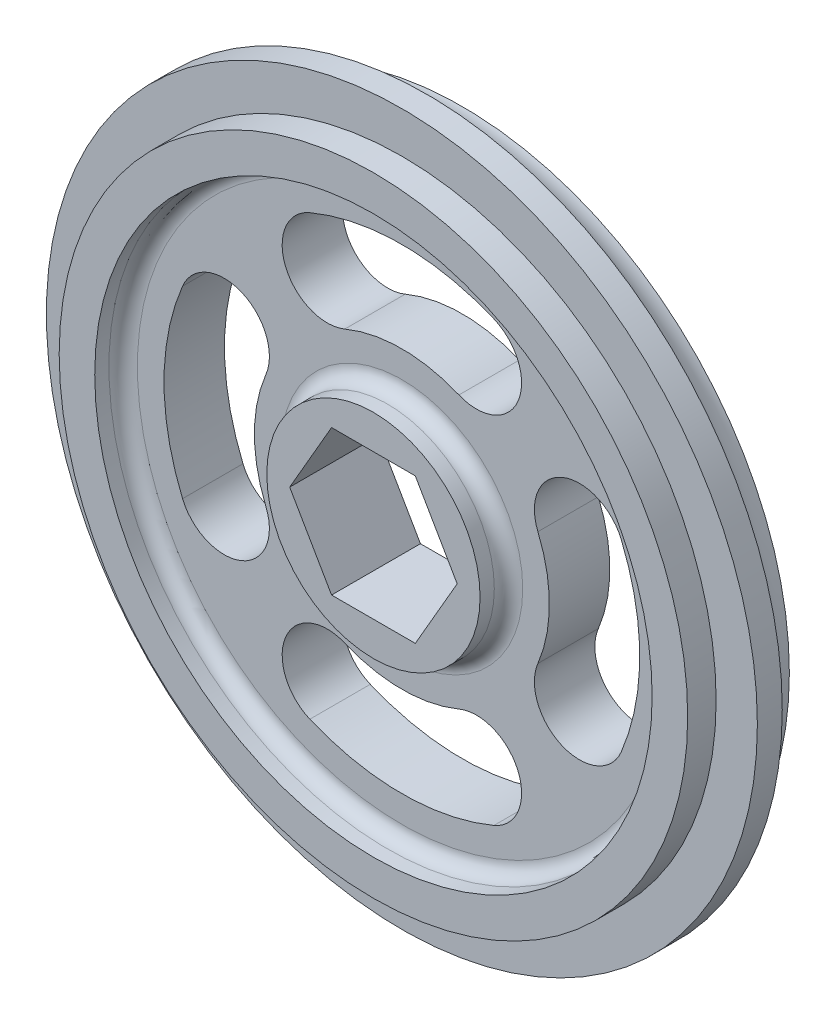
ISO-10303-21;
HEADER;
FILE_DESCRIPTION(('STEP AP214'),'2;1');
FILE_NAME('part.step','',(''),(''),'','','');
FILE_SCHEMA(('AUTOMOTIVE_DESIGN { 1 0 10303 214 1 1 1 1 }'));
ENDSEC;
DATA;
#1=APPLICATION_CONTEXT('core data for automotive mechanical design processes');
#2=APPLICATION_PROTOCOL_DEFINITION('international standard','automotive_design',2000,#1);
#3=PRODUCT_CONTEXT('',#1,'mechanical');
#4=PRODUCT('Part','Part','',(#3));
#5=PRODUCT_RELATED_PRODUCT_CATEGORY('part','',(#4));
#6=PRODUCT_DEFINITION_FORMATION('','',#4);
#7=PRODUCT_DEFINITION_CONTEXT('part definition',#1,'design');
#8=PRODUCT_DEFINITION('design','',#6,#7);
#9=PRODUCT_DEFINITION_SHAPE('','',#8);
#10=(LENGTH_UNIT() NAMED_UNIT(*) SI_UNIT(.MILLI.,.METRE.));
#11=(NAMED_UNIT(*) PLANE_ANGLE_UNIT() SI_UNIT($,.RADIAN.));
#12=(NAMED_UNIT(*) SI_UNIT($,.STERADIAN.) SOLID_ANGLE_UNIT());
#13=UNCERTAINTY_MEASURE_WITH_UNIT(LENGTH_MEASURE(1.E-05),#10,'distance_accuracy_value','');
#14=(GEOMETRIC_REPRESENTATION_CONTEXT(3) GLOBAL_UNCERTAINTY_ASSIGNED_CONTEXT((#13)) GLOBAL_UNIT_ASSIGNED_CONTEXT((#10,
#11,#12)) REPRESENTATION_CONTEXT('',''));
#15=CARTESIAN_POINT('',(0.,0.,0.));
#16=DIRECTION('',(0.,0.,1.));
#17=DIRECTION('',(1.,0.,0.));
#18=AXIS2_PLACEMENT_3D('',#15,#16,#17);
#19=CARTESIAN_POINT('',(-3.7394976935412,6.477,15.875));
#20=DIRECTION('',(0.866025403784439,-0.5,0.));
#21=DIRECTION('',(0.5,0.866025403784439,0.));
#22=AXIS2_PLACEMENT_3D('',#19,#20,#21);
#23=PLANE('',#22);
#24=DIRECTION('',(0.,0.,-1.));
#25=VECTOR('',#24,1.);
#26=CARTESIAN_POINT('',(-7.47899538708241,0.,15.875));
#27=LINE('',#26,#25);
#28=CARTESIAN_POINT('',(-7.47899538708241,0.,15.875));
#29=VERTEX_POINT('',#28);
#30=CARTESIAN_POINT('',(-7.47899538708241,0.,7.9375));
#31=VERTEX_POINT('',#30);
#32=EDGE_CURVE('E319',#29,#31,#27,.T.);
#33=ORIENTED_EDGE('',*,*,#32,.T.);
#34=DIRECTION('',(0.5,0.866025403784439,0.));
#35=VECTOR('',#34,1.);
#36=CARTESIAN_POINT('',(-3.7394976935412,6.477,7.9375));
#37=LINE('',#36,#35);
#38=CARTESIAN_POINT('',(-3.73949769354121,6.477,7.9375));
#39=VERTEX_POINT('',#38);
#40=EDGE_CURVE('E237',#31,#39,#37,.T.);
#41=ORIENTED_EDGE('',*,*,#40,.T.);
#42=DIRECTION('',(0.,0.,-1.));
#43=VECTOR('',#42,1.);
#44=CARTESIAN_POINT('',(-3.7394976935412,6.477,15.875));
#45=LINE('',#44,#43);
#46=CARTESIAN_POINT('',(-3.7394976935412,6.477,15.875));
#47=VERTEX_POINT('',#46);
#48=EDGE_CURVE('E304',#47,#39,#45,.T.);
#49=ORIENTED_EDGE('',*,*,#48,.F.);
#50=DIRECTION('',(-0.5,-0.866025403784439,0.));
#51=VECTOR('',#50,1.);
#52=CARTESIAN_POINT('',(-3.7394976935412,6.477,15.875));
#53=LINE('',#52,#51);
#54=EDGE_CURVE('E291',#47,#29,#53,.T.);
#55=ORIENTED_EDGE('',*,*,#54,.T.);
#56=EDGE_LOOP('',(#33,#41,#49,#55));
#57=FACE_BOUND('',#56,.T.);
#58=ADVANCED_FACE('F33',(#57),#23,.T.);
#59=CARTESIAN_POINT('',(-7.47899538708241,0.,15.875));
#60=DIRECTION('',(0.866025403784439,0.5,0.));
#61=DIRECTION('',(-0.5,0.866025403784439,0.));
#62=AXIS2_PLACEMENT_3D('',#59,#60,#61);
#63=PLANE('',#62);
#64=DIRECTION('',(0.,0.,-1.));
#65=VECTOR('',#64,1.);
#66=CARTESIAN_POINT('',(-3.73949769354121,-6.477,15.875));
#67=LINE('',#66,#65);
#68=CARTESIAN_POINT('',(-3.73949769354121,-6.477,15.875));
#69=VERTEX_POINT('',#68);
#70=CARTESIAN_POINT('',(-3.73949769354121,-6.477,7.9375));
#71=VERTEX_POINT('',#70);
#72=EDGE_CURVE('E316',#69,#71,#67,.T.);
#73=ORIENTED_EDGE('',*,*,#72,.T.);
#74=DIRECTION('',(-0.5,0.866025403784439,0.));
#75=VECTOR('',#74,1.);
#76=CARTESIAN_POINT('',(-7.47899538708241,0.,7.9375));
#77=LINE('',#76,#75);
#78=EDGE_CURVE('E400',#71,#31,#77,.T.);
#79=ORIENTED_EDGE('',*,*,#78,.T.);
#80=ORIENTED_EDGE('',*,*,#32,.F.);
#81=DIRECTION('',(0.5,-0.866025403784439,0.));
#82=VECTOR('',#81,1.);
#83=CARTESIAN_POINT('',(-7.47899538708241,0.,15.875));
#84=LINE('',#83,#82);
#85=EDGE_CURVE('E293',#29,#69,#84,.T.);
#86=ORIENTED_EDGE('',*,*,#85,.T.);
#87=EDGE_LOOP('',(#73,#79,#80,#86));
#88=FACE_BOUND('',#87,.T.);
#89=ADVANCED_FACE('F348',(#88),#63,.T.);
#90=CARTESIAN_POINT('',(-3.73949769354121,-6.477,15.875));
#91=DIRECTION('',(0.,1.,0.));
#92=DIRECTION('',(-1.,0.,0.));
#93=AXIS2_PLACEMENT_3D('',#90,#91,#92);
#94=PLANE('',#93);
#95=DIRECTION('',(0.,0.,-1.));
#96=VECTOR('',#95,1.);
#97=CARTESIAN_POINT('',(3.7394976935412,-6.477,15.875));
#98=LINE('',#97,#96);
#99=CARTESIAN_POINT('',(3.7394976935412,-6.477,15.875));
#100=VERTEX_POINT('',#99);
#101=CARTESIAN_POINT('',(3.7394976935412,-6.477,7.9375));
#102=VERTEX_POINT('',#101);
#103=EDGE_CURVE('E313',#100,#102,#98,.T.);
#104=ORIENTED_EDGE('',*,*,#103,.T.);
#105=DIRECTION('',(-1.,0.,0.));
#106=VECTOR('',#105,1.);
#107=CARTESIAN_POINT('',(-3.73949769354121,-6.477,7.9375));
#108=LINE('',#107,#106);
#109=EDGE_CURVE('E397',#102,#71,#108,.T.);
#110=ORIENTED_EDGE('',*,*,#109,.T.);
#111=ORIENTED_EDGE('',*,*,#72,.F.);
#112=DIRECTION('',(1.,0.,0.));
#113=VECTOR('',#112,1.);
#114=CARTESIAN_POINT('',(-3.73949769354121,-6.477,15.875));
#115=LINE('',#114,#113);
#116=EDGE_CURVE('E295',#69,#100,#115,.T.);
#117=ORIENTED_EDGE('',*,*,#116,.T.);
#118=EDGE_LOOP('',(#104,#110,#111,#117));
#119=FACE_BOUND('',#118,.T.);
#120=ADVANCED_FACE('F354',(#119),#94,.T.);
#121=CARTESIAN_POINT('',(3.7394976935412,-6.477,15.875));
#122=DIRECTION('',(-0.866025403784439,0.5,0.));
#123=DIRECTION('',(-0.5,-0.866025403784439,0.));
#124=AXIS2_PLACEMENT_3D('',#121,#122,#123);
#125=PLANE('',#124);
#126=DIRECTION('',(0.,0.,-1.));
#127=VECTOR('',#126,1.);
#128=CARTESIAN_POINT('',(7.47899538708241,0.,15.875));
#129=LINE('',#128,#127);
#130=CARTESIAN_POINT('',(7.47899538708241,0.,15.875));
#131=VERTEX_POINT('',#130);
#132=CARTESIAN_POINT('',(7.47899538708241,0.,7.9375));
#133=VERTEX_POINT('',#132);
#134=EDGE_CURVE('E310',#131,#133,#129,.T.);
#135=ORIENTED_EDGE('',*,*,#134,.T.);
#136=DIRECTION('',(-0.5,-0.866025403784439,0.));
#137=VECTOR('',#136,1.);
#138=CARTESIAN_POINT('',(3.7394976935412,-6.477,7.9375));
#139=LINE('',#138,#137);
#140=EDGE_CURVE('E394',#133,#102,#139,.T.);
#141=ORIENTED_EDGE('',*,*,#140,.T.);
#142=ORIENTED_EDGE('',*,*,#103,.F.);
#143=DIRECTION('',(0.5,0.866025403784439,0.));
#144=VECTOR('',#143,1.);
#145=CARTESIAN_POINT('',(3.7394976935412,-6.477,15.875));
#146=LINE('',#145,#144);
#147=EDGE_CURVE('E297',#100,#131,#146,.T.);
#148=ORIENTED_EDGE('',*,*,#147,.T.);
#149=EDGE_LOOP('',(#135,#141,#142,#148));
#150=FACE_BOUND('',#149,.T.);
#151=ADVANCED_FACE('F539',(#150),#125,.T.);
#152=CARTESIAN_POINT('',(7.47899538708241,0.,15.875));
#153=DIRECTION('',(-0.866025403784438,-0.5,0.));
#154=DIRECTION('',(0.5,-0.866025403784439,0.));
#155=AXIS2_PLACEMENT_3D('',#152,#153,#154);
#156=PLANE('',#155);
#157=DIRECTION('',(0.,0.,-1.));
#158=VECTOR('',#157,1.);
#159=CARTESIAN_POINT('',(3.7394976935412,6.477,15.875));
#160=LINE('',#159,#158);
#161=CARTESIAN_POINT('',(3.7394976935412,6.477,15.875));
#162=VERTEX_POINT('',#161);
#163=CARTESIAN_POINT('',(3.7394976935412,6.477,7.9375));
#164=VERTEX_POINT('',#163);
#165=EDGE_CURVE('E307',#162,#164,#160,.T.);
#166=ORIENTED_EDGE('',*,*,#165,.T.);
#167=DIRECTION('',(0.5,-0.866025403784439,0.));
#168=VECTOR('',#167,1.);
#169=CARTESIAN_POINT('',(7.47899538708241,0.,7.9375));
#170=LINE('',#169,#168);
#171=EDGE_CURVE('E48',#164,#133,#170,.T.);
#172=ORIENTED_EDGE('',*,*,#171,.T.);
#173=ORIENTED_EDGE('',*,*,#134,.F.);
#174=DIRECTION('',(-0.5,0.866025403784438,0.));
#175=VECTOR('',#174,1.);
#176=CARTESIAN_POINT('',(7.47899538708241,0.,15.875));
#177=LINE('',#176,#175);
#178=EDGE_CURVE('E299',#131,#162,#177,.T.);
#179=ORIENTED_EDGE('',*,*,#178,.T.);
#180=EDGE_LOOP('',(#166,#172,#173,#179));
#181=FACE_BOUND('',#180,.T.);
#182=ADVANCED_FACE('F535',(#181),#156,.T.);
#183=CARTESIAN_POINT('',(3.7394976935412,6.477,15.875));
#184=DIRECTION('',(0.,-1.,0.));
#185=DIRECTION('',(0.,0.,-1.));
#186=AXIS2_PLACEMENT_3D('',#183,#184,#185);
#187=PLANE('',#186);
#188=ORIENTED_EDGE('',*,*,#48,.T.);
#189=DIRECTION('',(1.,0.,0.));
#190=VECTOR('',#189,1.);
#191=CARTESIAN_POINT('',(3.7394976935412,6.477,7.9375));
#192=LINE('',#191,#190);
#193=EDGE_CURVE('E386',#39,#164,#192,.T.);
#194=ORIENTED_EDGE('',*,*,#193,.T.);
#195=ORIENTED_EDGE('',*,*,#165,.F.);
#196=DIRECTION('',(-1.,0.,0.));
#197=VECTOR('',#196,1.);
#198=CARTESIAN_POINT('',(3.7394976935412,6.477,15.875));
#199=LINE('',#198,#197);
#200=EDGE_CURVE('E302',#162,#47,#199,.T.);
#201=ORIENTED_EDGE('',*,*,#200,.T.);
#202=EDGE_LOOP('',(#188,#194,#195,#201));
#203=FACE_BOUND('',#202,.T.);
#204=ADVANCED_FACE('F380',(#203),#187,.T.);
#205=CARTESIAN_POINT('',(0.,0.,7.9375));
#206=DIRECTION('',(0.,0.,1.));
#207=DIRECTION('',(1.,0.,0.));
#208=AXIS2_PLACEMENT_3D('',#205,#206,#207);
#209=TOROIDAL_SURFACE('',#208,32.464375,3.254375);
#210=CARTESIAN_POINT('',(0.,0.,11.1125));
#211=DIRECTION('',(0.,0.,1.));
#212=DIRECTION('',(1.,0.,0.));
#213=AXIS2_PLACEMENT_3D('',#210,#211,#212);
#214=CIRCLE('',#213,31.75);
#215=CARTESIAN_POINT('',(31.75,0.,11.1125));
#216=VERTEX_POINT('',#215);
#217=EDGE_CURVE('E279',#216,#216,#214,.T.);
#218=ORIENTED_EDGE('',*,*,#217,.F.);
#219=EDGE_LOOP('',(#218));
#220=FACE_BOUND('',#219,.T.);
#221=CARTESIAN_POINT('',(0.,0.,7.9375));
#222=DIRECTION('',(0.,0.,1.));
#223=DIRECTION('',(1.,0.,0.));
#224=AXIS2_PLACEMENT_3D('',#221,#222,#223);
#225=CIRCLE('',#224,29.21);
#226=CARTESIAN_POINT('',(29.21,0.,7.9375));
#227=VERTEX_POINT('',#226);
#228=EDGE_CURVE('E384',#227,#227,#225,.T.);
#229=ORIENTED_EDGE('',*,*,#228,.T.);
#230=EDGE_LOOP('',(#229));
#231=FACE_BOUND('',#230,.T.);
#232=ADVANCED_FACE('F376',(#220,#231),#209,.F.);
#233=CARTESIAN_POINT('',(15.8685472556239,-6.65745298489088,0.));
#234=DIRECTION('',(0.,0.,1.));
#235=DIRECTION('',(1.,0.,0.));
#236=AXIS2_PLACEMENT_3D('',#233,#234,#235);
#237=CYLINDRICAL_SURFACE('',#236,4.03483822348317);
#238=CARTESIAN_POINT('',(15.8685472556239,-6.65745298489088,7.9375));
#239=DIRECTION('',(0.,0.,-1.));
#240=DIRECTION('',(-1.,0.,0.));
#241=AXIS2_PLACEMENT_3D('',#238,#239,#240);
#242=CIRCLE('',#241,4.03483822348317);
#243=CARTESIAN_POINT('',(12.1478847331413,-5.09649498306156,7.9375));
#244=VERTEX_POINT('',#243);
#245=CARTESIAN_POINT('',(19.5892097781064,-8.21841098672021,7.9375));
#246=VERTEX_POINT('',#245);
#247=EDGE_CURVE('E56',#244,#246,#242,.F.);
#248=ORIENTED_EDGE('',*,*,#247,.F.);
#249=DIRECTION('',(0.,0.,1.));
#250=VECTOR('',#249,1.);
#251=CARTESIAN_POINT('',(12.1478847331413,-5.09649498306156,0.));
#252=LINE('',#251,#250);
#253=CARTESIAN_POINT('',(12.1478847331413,-5.09649498306156,13.335));
#254=VERTEX_POINT('',#253);
#255=EDGE_CURVE('E266',#244,#254,#252,.T.);
#256=ORIENTED_EDGE('',*,*,#255,.T.);
#257=CARTESIAN_POINT('',(15.8685472556239,-6.65745298489088,13.335));
#258=DIRECTION('',(0.,0.,1.));
#259=DIRECTION('',(1.,0.,0.));
#260=AXIS2_PLACEMENT_3D('',#257,#258,#259);
#261=CIRCLE('',#260,4.03483822348317);
#262=CARTESIAN_POINT('',(19.5892097781064,-8.21841098672021,13.335));
#263=VERTEX_POINT('',#262);
#264=EDGE_CURVE('E253',#254,#263,#261,.T.);
#265=ORIENTED_EDGE('',*,*,#264,.T.);
#266=DIRECTION('',(0.,0.,1.));
#267=VECTOR('',#266,1.);
#268=CARTESIAN_POINT('',(19.5892097781064,-8.21841098672021,0.));
#269=LINE('',#268,#267);
#270=EDGE_CURVE('E265',#246,#263,#269,.T.);
#271=ORIENTED_EDGE('',*,*,#270,.F.);
#272=EDGE_LOOP('',(#248,#256,#265,#271));
#273=FACE_BOUND('',#272,.T.);
#274=ADVANCED_FACE('F379',(#273),#237,.F.);
#275=CARTESIAN_POINT('',(0.,0.,0.));
#276=DIRECTION('',(0.,0.,1.));
#277=DIRECTION('',(1.,0.,0.));
#278=AXIS2_PLACEMENT_3D('',#275,#276,#277);
#279=CYLINDRICAL_SURFACE('',#278,13.1736617765168);
#280=CARTESIAN_POINT('',(0.,0.,7.9375));
#281=DIRECTION('',(0.,0.,-1.));
#282=DIRECTION('',(-1.,0.,0.));
#283=AXIS2_PLACEMENT_3D('',#280,#281,#282);
#284=CIRCLE('',#283,13.1736617765168);
#285=CARTESIAN_POINT('',(12.1478847331413,5.09649498306156,7.9375));
#286=VERTEX_POINT('',#285);
#287=EDGE_CURVE('E389',#286,#244,#284,.T.);
#288=ORIENTED_EDGE('',*,*,#287,.F.);
#289=DIRECTION('',(0.,0.,1.));
#290=VECTOR('',#289,1.);
#291=CARTESIAN_POINT('',(12.1478847331413,5.09649498306156,0.));
#292=LINE('',#291,#290);
#293=CARTESIAN_POINT('',(12.1478847331413,5.09649498306156,13.335));
#294=VERTEX_POINT('',#293);
#295=EDGE_CURVE('E269',#286,#294,#292,.T.);
#296=ORIENTED_EDGE('',*,*,#295,.T.);
#297=CARTESIAN_POINT('',(0.,0.,13.335));
#298=DIRECTION('',(0.,0.,-1.));
#299=DIRECTION('',(1.,0.,0.));
#300=AXIS2_PLACEMENT_3D('',#297,#298,#299);
#301=CIRCLE('',#300,13.1736617765168);
#302=EDGE_CURVE('E262',#294,#254,#301,.T.);
#303=ORIENTED_EDGE('',*,*,#302,.T.);
#304=ORIENTED_EDGE('',*,*,#255,.F.);
#305=EDGE_LOOP('',(#288,#296,#303,#304));
#306=FACE_BOUND('',#305,.T.);
#307=ADVANCED_FACE('F442',(#306),#279,.T.);
#308=CARTESIAN_POINT('',(15.8685472556239,6.65745298489088,0.));
#309=DIRECTION('',(0.,0.,1.));
#310=DIRECTION('',(1.,0.,0.));
#311=AXIS2_PLACEMENT_3D('',#308,#309,#310);
#312=CYLINDRICAL_SURFACE('',#311,4.03483822348318);
#313=CARTESIAN_POINT('',(15.8685472556239,6.65745298489088,7.9375));
#314=DIRECTION('',(0.,0.,-1.));
#315=DIRECTION('',(-1.,0.,0.));
#316=AXIS2_PLACEMENT_3D('',#313,#314,#315);
#317=CIRCLE('',#316,4.03483822348318);
#318=CARTESIAN_POINT('',(19.5892097781064,8.2184109867202,7.9375));
#319=VERTEX_POINT('',#318);
#320=EDGE_CURVE('E448',#319,#286,#317,.F.);
#321=ORIENTED_EDGE('',*,*,#320,.F.);
#322=DIRECTION('',(0.,0.,1.));
#323=VECTOR('',#322,1.);
#324=CARTESIAN_POINT('',(19.5892097781064,8.2184109867202,0.));
#325=LINE('',#324,#323);
#326=CARTESIAN_POINT('',(19.5892097781064,8.2184109867202,13.335));
#327=VERTEX_POINT('',#326);
#328=EDGE_CURVE('E271',#319,#327,#325,.T.);
#329=ORIENTED_EDGE('',*,*,#328,.T.);
#330=CARTESIAN_POINT('',(15.8685472556239,6.65745298489088,13.335));
#331=DIRECTION('',(0.,0.,1.));
#332=DIRECTION('',(1.,0.,0.));
#333=AXIS2_PLACEMENT_3D('',#330,#331,#332);
#334=CIRCLE('',#333,4.03483822348318);
#335=EDGE_CURVE('E259',#327,#294,#334,.T.);
#336=ORIENTED_EDGE('',*,*,#335,.T.);
#337=ORIENTED_EDGE('',*,*,#295,.F.);
#338=EDGE_LOOP('',(#321,#329,#336,#337));
#339=FACE_BOUND('',#338,.T.);
#340=ADVANCED_FACE('F446',(#339),#312,.F.);
#341=CARTESIAN_POINT('',(0.,0.,0.));
#342=DIRECTION('',(0.,0.,1.));
#343=DIRECTION('',(1.,0.,0.));
#344=AXIS2_PLACEMENT_3D('',#341,#342,#343);
#345=CYLINDRICAL_SURFACE('',#344,21.2433382234832);
#346=CARTESIAN_POINT('',(0.,0.,7.9375));
#347=DIRECTION('',(0.,0.,-1.));
#348=DIRECTION('',(-1.,0.,0.));
#349=AXIS2_PLACEMENT_3D('',#346,#347,#348);
#350=CIRCLE('',#349,21.2433382234832);
#351=EDGE_CURVE('E451',#246,#319,#350,.F.);
#352=ORIENTED_EDGE('',*,*,#351,.F.);
#353=ORIENTED_EDGE('',*,*,#270,.T.);
#354=CARTESIAN_POINT('',(0.,0.,13.335));
#355=DIRECTION('',(0.,0.,1.));
#356=DIRECTION('',(1.,0.,0.));
#357=AXIS2_PLACEMENT_3D('',#354,#355,#356);
#358=CIRCLE('',#357,21.2433382234832);
#359=EDGE_CURVE('E256',#263,#327,#358,.T.);
#360=ORIENTED_EDGE('',*,*,#359,.T.);
#361=ORIENTED_EDGE('',*,*,#328,.F.);
#362=EDGE_LOOP('',(#352,#353,#360,#361));
#363=FACE_BOUND('',#362,.T.);
#364=ADVANCED_FACE('F450',(#363),#345,.F.);
#365=CARTESIAN_POINT('',(6.65745298489088,15.8685472556239,0.));
#366=DIRECTION('',(0.,0.,1.));
#367=DIRECTION('',(1.,0.,0.));
#368=AXIS2_PLACEMENT_3D('',#365,#366,#367);
#369=CYLINDRICAL_SURFACE('',#368,4.03483822348318);
#370=CARTESIAN_POINT('',(6.65745298489088,15.8685472556239,7.9375));
#371=DIRECTION('',(0.,0.,-1.));
#372=DIRECTION('',(-1.,0.,0.));
#373=AXIS2_PLACEMENT_3D('',#370,#371,#372);
#374=CIRCLE('',#373,4.03483822348318);
#375=CARTESIAN_POINT('',(5.09649498306156,12.1478847331414,7.9375));
#376=VERTEX_POINT('',#375);
#377=CARTESIAN_POINT('',(8.2184109867202,19.5892097781064,7.9375));
#378=VERTEX_POINT('',#377);
#379=EDGE_CURVE('E452',#376,#378,#374,.F.);
#380=ORIENTED_EDGE('',*,*,#379,.F.);
#381=DIRECTION('',(0.,0.,1.));
#382=VECTOR('',#381,1.);
#383=CARTESIAN_POINT('',(5.09649498306156,12.1478847331414,0.));
#384=LINE('',#383,#382);
#385=CARTESIAN_POINT('',(5.09649498306156,12.1478847331414,13.335));
#386=VERTEX_POINT('',#385);
#387=EDGE_CURVE('E215',#376,#386,#384,.T.);
#388=ORIENTED_EDGE('',*,*,#387,.T.);
#389=CARTESIAN_POINT('',(6.65745298489088,15.8685472556239,13.335));
#390=DIRECTION('',(0.,0.,1.));
#391=DIRECTION('',(1.,0.,0.));
#392=AXIS2_PLACEMENT_3D('',#389,#390,#391);
#393=CIRCLE('',#392,4.03483822348318);
#394=CARTESIAN_POINT('',(8.2184109867202,19.5892097781064,13.335));
#395=VERTEX_POINT('',#394);
#396=EDGE_CURVE('E233',#386,#395,#393,.T.);
#397=ORIENTED_EDGE('',*,*,#396,.T.);
#398=DIRECTION('',(0.,0.,1.));
#399=VECTOR('',#398,1.);
#400=CARTESIAN_POINT('',(8.2184109867202,19.5892097781064,0.));
#401=LINE('',#400,#399);
#402=EDGE_CURVE('E246',#378,#395,#401,.T.);
#403=ORIENTED_EDGE('',*,*,#402,.F.);
#404=EDGE_LOOP('',(#380,#388,#397,#403));
#405=FACE_BOUND('',#404,.T.);
#406=ADVANCED_FACE('F506',(#405),#369,.F.);
#407=CARTESIAN_POINT('',(0.,0.,0.));
#408=DIRECTION('',(0.,0.,1.));
#409=DIRECTION('',(1.,0.,0.));
#410=AXIS2_PLACEMENT_3D('',#407,#408,#409);
#411=CYLINDRICAL_SURFACE('',#410,13.1736617765168);
#412=CARTESIAN_POINT('',(0.,0.,7.9375));
#413=DIRECTION('',(0.,0.,-1.));
#414=DIRECTION('',(-1.,0.,0.));
#415=AXIS2_PLACEMENT_3D('',#412,#413,#414);
#416=CIRCLE('',#415,13.1736617765168);
#417=CARTESIAN_POINT('',(-5.09649498306156,12.1478847331414,7.9375));
#418=VERTEX_POINT('',#417);
#419=EDGE_CURVE('E455',#418,#376,#416,.T.);
#420=ORIENTED_EDGE('',*,*,#419,.F.);
#421=DIRECTION('',(0.,0.,1.));
#422=VECTOR('',#421,1.);
#423=CARTESIAN_POINT('',(-5.09649498306156,12.1478847331414,0.));
#424=LINE('',#423,#422);
#425=CARTESIAN_POINT('',(-5.09649498306156,12.1478847331414,13.335));
#426=VERTEX_POINT('',#425);
#427=EDGE_CURVE('E248',#418,#426,#424,.T.);
#428=ORIENTED_EDGE('',*,*,#427,.T.);
#429=CARTESIAN_POINT('',(0.,0.,13.335));
#430=DIRECTION('',(0.,0.,-1.));
#431=DIRECTION('',(1.,0.,0.));
#432=AXIS2_PLACEMENT_3D('',#429,#430,#431);
#433=CIRCLE('',#432,13.1736617765168);
#434=EDGE_CURVE('E243',#426,#386,#433,.T.);
#435=ORIENTED_EDGE('',*,*,#434,.T.);
#436=ORIENTED_EDGE('',*,*,#387,.F.);
#437=EDGE_LOOP('',(#420,#428,#435,#436));
#438=FACE_BOUND('',#437,.T.);
#439=ADVANCED_FACE('F503',(#438),#411,.T.);
#440=CARTESIAN_POINT('',(-6.65745298489088,15.8685472556239,0.));
#441=DIRECTION('',(0.,0.,1.));
#442=DIRECTION('',(1.,0.,0.));
#443=AXIS2_PLACEMENT_3D('',#440,#441,#442);
#444=CYLINDRICAL_SURFACE('',#443,4.03483822348318);
#445=CARTESIAN_POINT('',(-6.65745298489088,15.8685472556239,7.9375));
#446=DIRECTION('',(0.,0.,-1.));
#447=DIRECTION('',(-1.,0.,0.));
#448=AXIS2_PLACEMENT_3D('',#445,#446,#447);
#449=CIRCLE('',#448,4.03483822348318);
#450=CARTESIAN_POINT('',(-8.2184109867202,19.5892097781064,7.9375));
#451=VERTEX_POINT('',#450);
#452=EDGE_CURVE('E459',#451,#418,#449,.F.);
#453=ORIENTED_EDGE('',*,*,#452,.F.);
#454=DIRECTION('',(0.,0.,1.));
#455=VECTOR('',#454,1.);
#456=CARTESIAN_POINT('',(-8.2184109867202,19.5892097781064,0.));
#457=LINE('',#456,#455);
#458=CARTESIAN_POINT('',(-8.2184109867202,19.5892097781064,13.335));
#459=VERTEX_POINT('',#458);
#460=EDGE_CURVE('E250',#451,#459,#457,.T.);
#461=ORIENTED_EDGE('',*,*,#460,.T.);
#462=CARTESIAN_POINT('',(-6.65745298489088,15.8685472556239,13.335));
#463=DIRECTION('',(0.,0.,1.));
#464=DIRECTION('',(1.,0.,0.));
#465=AXIS2_PLACEMENT_3D('',#462,#463,#464);
#466=CIRCLE('',#465,4.03483822348318);
#467=EDGE_CURVE('E240',#459,#426,#466,.T.);
#468=ORIENTED_EDGE('',*,*,#467,.T.);
#469=ORIENTED_EDGE('',*,*,#427,.F.);
#470=EDGE_LOOP('',(#453,#461,#468,#469));
#471=FACE_BOUND('',#470,.T.);
#472=ADVANCED_FACE('F497',(#471),#444,.F.);
#473=CARTESIAN_POINT('',(0.,0.,0.));
#474=DIRECTION('',(0.,0.,1.));
#475=DIRECTION('',(1.,0.,0.));
#476=AXIS2_PLACEMENT_3D('',#473,#474,#475);
#477=CYLINDRICAL_SURFACE('',#476,21.2433382234832);
#478=CARTESIAN_POINT('',(0.,0.,7.9375));
#479=DIRECTION('',(0.,0.,-1.));
#480=DIRECTION('',(-1.,0.,0.));
#481=AXIS2_PLACEMENT_3D('',#478,#479,#480);
#482=CIRCLE('',#481,21.2433382234832);
#483=EDGE_CURVE('E461',#378,#451,#482,.F.);
#484=ORIENTED_EDGE('',*,*,#483,.F.);
#485=ORIENTED_EDGE('',*,*,#402,.T.);
#486=CARTESIAN_POINT('',(0.,0.,13.335));
#487=DIRECTION('',(0.,0.,1.));
#488=DIRECTION('',(1.,0.,0.));
#489=AXIS2_PLACEMENT_3D('',#486,#487,#488);
#490=CIRCLE('',#489,21.2433382234832);
#491=EDGE_CURVE('E236',#395,#459,#490,.T.);
#492=ORIENTED_EDGE('',*,*,#491,.T.);
#493=ORIENTED_EDGE('',*,*,#460,.F.);
#494=EDGE_LOOP('',(#484,#485,#492,#493));
#495=FACE_BOUND('',#494,.T.);
#496=ADVANCED_FACE('F490',(#495),#477,.F.);
#497=CARTESIAN_POINT('',(-15.8685472556239,6.65745298489088,0.));
#498=DIRECTION('',(0.,0.,1.));
#499=DIRECTION('',(1.,0.,0.));
#500=AXIS2_PLACEMENT_3D('',#497,#498,#499);
#501=CYLINDRICAL_SURFACE('',#500,4.03483822348318);
#502=CARTESIAN_POINT('',(-15.8685472556239,6.65745298489088,7.9375));
#503=DIRECTION('',(0.,0.,-1.));
#504=DIRECTION('',(-1.,0.,0.));
#505=AXIS2_PLACEMENT_3D('',#502,#503,#504);
#506=CIRCLE('',#505,4.03483822348318);
#507=CARTESIAN_POINT('',(-12.1478847331414,5.09649498306156,7.9375));
#508=VERTEX_POINT('',#507);
#509=CARTESIAN_POINT('',(-19.5892097781064,8.21841098672021,7.9375));
#510=VERTEX_POINT('',#509);
#511=EDGE_CURVE('E463',#508,#510,#506,.F.);
#512=ORIENTED_EDGE('',*,*,#511,.F.);
#513=DIRECTION('',(0.,0.,1.));
#514=VECTOR('',#513,1.);
#515=CARTESIAN_POINT('',(-12.1478847331414,5.09649498306156,0.));
#516=LINE('',#515,#514);
#517=CARTESIAN_POINT('',(-12.1478847331414,5.09649498306156,13.335));
#518=VERTEX_POINT('',#517);
#519=EDGE_CURVE('E225',#508,#518,#516,.T.);
#520=ORIENTED_EDGE('',*,*,#519,.T.);
#521=CARTESIAN_POINT('',(-15.8685472556239,6.65745298489088,13.335));
#522=DIRECTION('',(0.,0.,1.));
#523=DIRECTION('',(1.,0.,0.));
#524=AXIS2_PLACEMENT_3D('',#521,#522,#523);
#525=CIRCLE('',#524,4.03483822348318);
#526=CARTESIAN_POINT('',(-19.5892097781064,8.21841098672021,13.335));
#527=VERTEX_POINT('',#526);
#528=EDGE_CURVE('E211',#518,#527,#525,.T.);
#529=ORIENTED_EDGE('',*,*,#528,.T.);
#530=DIRECTION('',(0.,0.,1.));
#531=VECTOR('',#530,1.);
#532=CARTESIAN_POINT('',(-19.5892097781064,8.21841098672021,0.));
#533=LINE('',#532,#531);
#534=EDGE_CURVE('E224',#510,#527,#533,.T.);
#535=ORIENTED_EDGE('',*,*,#534,.F.);
#536=EDGE_LOOP('',(#512,#520,#529,#535));
#537=FACE_BOUND('',#536,.T.);
#538=ADVANCED_FACE('F488',(#537),#501,.F.);
#539=CARTESIAN_POINT('',(0.,0.,0.));
#540=DIRECTION('',(0.,0.,1.));
#541=DIRECTION('',(1.,0.,0.));
#542=AXIS2_PLACEMENT_3D('',#539,#540,#541);
#543=CYLINDRICAL_SURFACE('',#542,13.1736617765168);
#544=CARTESIAN_POINT('',(0.,0.,7.9375));
#545=DIRECTION('',(0.,0.,-1.));
#546=DIRECTION('',(-1.,0.,0.));
#547=AXIS2_PLACEMENT_3D('',#544,#545,#546);
#548=CIRCLE('',#547,13.1736617765168);
#549=CARTESIAN_POINT('',(-12.1478847331413,-5.09649498306156,7.9375));
#550=VERTEX_POINT('',#549);
#551=EDGE_CURVE('E465',#550,#508,#548,.T.);
#552=ORIENTED_EDGE('',*,*,#551,.F.);
#553=DIRECTION('',(0.,0.,1.));
#554=VECTOR('',#553,1.);
#555=CARTESIAN_POINT('',(-12.1478847331413,-5.09649498306156,0.));
#556=LINE('',#555,#554);
#557=CARTESIAN_POINT('',(-12.1478847331413,-5.09649498306156,13.335));
#558=VERTEX_POINT('',#557);
#559=EDGE_CURVE('E228',#550,#558,#556,.T.);
#560=ORIENTED_EDGE('',*,*,#559,.T.);
#561=CARTESIAN_POINT('',(0.,0.,13.335));
#562=DIRECTION('',(0.,0.,-1.));
#563=DIRECTION('',(1.,0.,0.));
#564=AXIS2_PLACEMENT_3D('',#561,#562,#563);
#565=CIRCLE('',#564,13.1736617765168);
#566=EDGE_CURVE('E221',#558,#518,#565,.T.);
#567=ORIENTED_EDGE('',*,*,#566,.T.);
#568=ORIENTED_EDGE('',*,*,#519,.F.);
#569=EDGE_LOOP('',(#552,#560,#567,#568));
#570=FACE_BOUND('',#569,.T.);
#571=ADVANCED_FACE('F486',(#570),#543,.T.);
#572=CARTESIAN_POINT('',(-15.8685472556239,-6.65745298489088,0.));
#573=DIRECTION('',(0.,0.,1.));
#574=DIRECTION('',(1.,0.,0.));
#575=AXIS2_PLACEMENT_3D('',#572,#573,#574);
#576=CYLINDRICAL_SURFACE('',#575,4.03483822348318);
#577=CARTESIAN_POINT('',(-15.8685472556239,-6.65745298489088,7.9375));
#578=DIRECTION('',(0.,0.,-1.));
#579=DIRECTION('',(-1.,0.,0.));
#580=AXIS2_PLACEMENT_3D('',#577,#578,#579);
#581=CIRCLE('',#580,4.03483822348318);
#582=CARTESIAN_POINT('',(-19.5892097781064,-8.2184109867202,7.9375));
#583=VERTEX_POINT('',#582);
#584=EDGE_CURVE('E467',#583,#550,#581,.F.);
#585=ORIENTED_EDGE('',*,*,#584,.F.);
#586=DIRECTION('',(0.,0.,1.));
#587=VECTOR('',#586,1.);
#588=CARTESIAN_POINT('',(-19.5892097781064,-8.2184109867202,0.));
#589=LINE('',#588,#587);
#590=CARTESIAN_POINT('',(-19.5892097781064,-8.2184109867202,13.335));
#591=VERTEX_POINT('',#590);
#592=EDGE_CURVE('E230',#583,#591,#589,.T.);
#593=ORIENTED_EDGE('',*,*,#592,.T.);
#594=CARTESIAN_POINT('',(-15.8685472556239,-6.65745298489088,13.335));
#595=DIRECTION('',(0.,0.,1.));
#596=DIRECTION('',(1.,0.,0.));
#597=AXIS2_PLACEMENT_3D('',#594,#595,#596);
#598=CIRCLE('',#597,4.03483822348318);
#599=EDGE_CURVE('E218',#591,#558,#598,.T.);
#600=ORIENTED_EDGE('',*,*,#599,.T.);
#601=ORIENTED_EDGE('',*,*,#559,.F.);
#602=EDGE_LOOP('',(#585,#593,#600,#601));
#603=FACE_BOUND('',#602,.T.);
#604=ADVANCED_FACE('F481',(#603),#576,.F.);
#605=CARTESIAN_POINT('',(0.,0.,0.));
#606=DIRECTION('',(0.,0.,1.));
#607=DIRECTION('',(1.,0.,0.));
#608=AXIS2_PLACEMENT_3D('',#605,#606,#607);
#609=CYLINDRICAL_SURFACE('',#608,21.2433382234832);
#610=CARTESIAN_POINT('',(0.,0.,7.9375));
#611=DIRECTION('',(0.,0.,-1.));
#612=DIRECTION('',(-1.,0.,0.));
#613=AXIS2_PLACEMENT_3D('',#610,#611,#612);
#614=CIRCLE('',#613,21.2433382234832);
#615=EDGE_CURVE('E469',#510,#583,#614,.F.);
#616=ORIENTED_EDGE('',*,*,#615,.F.);
#617=ORIENTED_EDGE('',*,*,#534,.T.);
#618=CARTESIAN_POINT('',(0.,0.,13.335));
#619=DIRECTION('',(0.,0.,1.));
#620=DIRECTION('',(1.,0.,0.));
#621=AXIS2_PLACEMENT_3D('',#618,#619,#620);
#622=CIRCLE('',#621,21.2433382234832);
#623=EDGE_CURVE('E214',#527,#591,#622,.T.);
#624=ORIENTED_EDGE('',*,*,#623,.T.);
#625=ORIENTED_EDGE('',*,*,#592,.F.);
#626=EDGE_LOOP('',(#616,#617,#624,#625));
#627=FACE_BOUND('',#626,.T.);
#628=ADVANCED_FACE('F482',(#627),#609,.F.);
#629=CARTESIAN_POINT('',(-6.65745298489088,-15.8685472556239,0.));
#630=DIRECTION('',(0.,0.,1.));
#631=DIRECTION('',(1.,0.,0.));
#632=AXIS2_PLACEMENT_3D('',#629,#630,#631);
#633=CYLINDRICAL_SURFACE('',#632,4.03483822348318);
#634=CARTESIAN_POINT('',(-6.65745298489088,-15.8685472556239,7.9375));
#635=DIRECTION('',(0.,0.,-1.));
#636=DIRECTION('',(-1.,0.,0.));
#637=AXIS2_PLACEMENT_3D('',#634,#635,#636);
#638=CIRCLE('',#637,4.03483822348318);
#639=CARTESIAN_POINT('',(-5.09649498306156,-12.1478847331414,7.9375));
#640=VERTEX_POINT('',#639);
#641=CARTESIAN_POINT('',(-8.2184109867202,-19.5892097781064,7.9375));
#642=VERTEX_POINT('',#641);
#643=EDGE_CURVE('E186',#640,#642,#638,.F.);
#644=ORIENTED_EDGE('',*,*,#643,.F.);
#645=DIRECTION('',(0.,0.,1.));
#646=VECTOR('',#645,1.);
#647=CARTESIAN_POINT('',(-5.09649498306156,-12.1478847331414,0.));
#648=LINE('',#647,#646);
#649=CARTESIAN_POINT('',(-5.09649498306156,-12.1478847331414,13.335));
#650=VERTEX_POINT('',#649);
#651=EDGE_CURVE('E205',#640,#650,#648,.T.);
#652=ORIENTED_EDGE('',*,*,#651,.T.);
#653=CARTESIAN_POINT('',(-6.65745298489088,-15.8685472556239,13.335));
#654=DIRECTION('',(0.,0.,1.));
#655=DIRECTION('',(1.,0.,0.));
#656=AXIS2_PLACEMENT_3D('',#653,#654,#655);
#657=CIRCLE('',#656,4.03483822348318);
#658=CARTESIAN_POINT('',(-8.2184109867202,-19.5892097781064,13.335));
#659=VERTEX_POINT('',#658);
#660=EDGE_CURVE('E227',#650,#659,#657,.T.);
#661=ORIENTED_EDGE('',*,*,#660,.T.);
#662=DIRECTION('',(0.,0.,1.));
#663=VECTOR('',#662,1.);
#664=CARTESIAN_POINT('',(-8.2184109867202,-19.5892097781064,0.));
#665=LINE('',#664,#663);
#666=EDGE_CURVE('E203',#642,#659,#665,.T.);
#667=ORIENTED_EDGE('',*,*,#666,.F.);
#668=EDGE_LOOP('',(#644,#652,#661,#667));
#669=FACE_BOUND('',#668,.T.);
#670=ADVANCED_FACE('F413',(#669),#633,.F.);
#671=CARTESIAN_POINT('',(0.,0.,0.));
#672=DIRECTION('',(0.,0.,1.));
#673=DIRECTION('',(1.,0.,0.));
#674=AXIS2_PLACEMENT_3D('',#671,#672,#673);
#675=CYLINDRICAL_SURFACE('',#674,13.1736617765168);
#676=CARTESIAN_POINT('',(0.,0.,7.9375));
#677=DIRECTION('',(0.,0.,-1.));
#678=DIRECTION('',(-1.,0.,0.));
#679=AXIS2_PLACEMENT_3D('',#676,#677,#678);
#680=CIRCLE('',#679,13.1736617765168);
#681=CARTESIAN_POINT('',(5.09649498306156,-12.1478847331414,7.9375));
#682=VERTEX_POINT('',#681);
#683=EDGE_CURVE('E197',#682,#640,#680,.T.);
#684=ORIENTED_EDGE('',*,*,#683,.F.);
#685=DIRECTION('',(0.,0.,1.));
#686=VECTOR('',#685,1.);
#687=CARTESIAN_POINT('',(5.09649498306156,-12.1478847331414,0.));
#688=LINE('',#687,#686);
#689=CARTESIAN_POINT('',(5.09649498306156,-12.1478847331414,13.335));
#690=VERTEX_POINT('',#689);
#691=EDGE_CURVE('E196',#682,#690,#688,.T.);
#692=ORIENTED_EDGE('',*,*,#691,.T.);
#693=CARTESIAN_POINT('',(0.,0.,13.335));
#694=DIRECTION('',(0.,0.,-1.));
#695=DIRECTION('',(1.,0.,0.));
#696=AXIS2_PLACEMENT_3D('',#693,#694,#695);
#697=CIRCLE('',#696,13.1736617765168);
#698=EDGE_CURVE('E207',#690,#650,#697,.T.);
#699=ORIENTED_EDGE('',*,*,#698,.T.);
#700=ORIENTED_EDGE('',*,*,#651,.F.);
#701=EDGE_LOOP('',(#684,#692,#699,#700));
#702=FACE_BOUND('',#701,.T.);
#703=ADVANCED_FACE('F417',(#702),#675,.T.);
#704=CARTESIAN_POINT('',(6.65745298489088,-15.8685472556239,0.));
#705=DIRECTION('',(0.,0.,1.));
#706=DIRECTION('',(1.,0.,0.));
#707=AXIS2_PLACEMENT_3D('',#704,#705,#706);
#708=CYLINDRICAL_SURFACE('',#707,4.03483822348317);
#709=CARTESIAN_POINT('',(6.65745298489088,-15.8685472556239,7.9375));
#710=DIRECTION('',(0.,0.,-1.));
#711=DIRECTION('',(-1.,0.,0.));
#712=AXIS2_PLACEMENT_3D('',#709,#710,#711);
#713=CIRCLE('',#712,4.03483822348317);
#714=CARTESIAN_POINT('',(8.2184109867202,-19.5892097781064,7.9375));
#715=VERTEX_POINT('',#714);
#716=EDGE_CURVE('E183',#715,#682,#713,.F.);
#717=ORIENTED_EDGE('',*,*,#716,.F.);
#718=DIRECTION('',(0.,0.,1.));
#719=VECTOR('',#718,1.);
#720=CARTESIAN_POINT('',(8.2184109867202,-19.5892097781064,0.));
#721=LINE('',#720,#719);
#722=CARTESIAN_POINT('',(8.2184109867202,-19.5892097781064,13.335));
#723=VERTEX_POINT('',#722);
#724=EDGE_CURVE('E194',#715,#723,#721,.T.);
#725=ORIENTED_EDGE('',*,*,#724,.T.);
#726=CARTESIAN_POINT('',(6.65745298489088,-15.8685472556239,13.335));
#727=DIRECTION('',(0.,0.,1.));
#728=DIRECTION('',(1.,0.,0.));
#729=AXIS2_PLACEMENT_3D('',#726,#727,#728);
#730=CIRCLE('',#729,4.03483822348317);
#731=EDGE_CURVE('E408',#723,#690,#730,.T.);
#732=ORIENTED_EDGE('',*,*,#731,.T.);
#733=ORIENTED_EDGE('',*,*,#691,.F.);
#734=EDGE_LOOP('',(#717,#725,#732,#733));
#735=FACE_BOUND('',#734,.T.);
#736=ADVANCED_FACE('F192',(#735),#708,.F.);
#737=CARTESIAN_POINT('',(0.,0.,0.));
#738=DIRECTION('',(0.,0.,1.));
#739=DIRECTION('',(1.,0.,0.));
#740=AXIS2_PLACEMENT_3D('',#737,#738,#739);
#741=CYLINDRICAL_SURFACE('',#740,21.2433382234832);
#742=CARTESIAN_POINT('',(0.,0.,7.9375));
#743=DIRECTION('',(0.,0.,-1.));
#744=DIRECTION('',(-1.,0.,0.));
#745=AXIS2_PLACEMENT_3D('',#742,#743,#744);
#746=CIRCLE('',#745,21.2433382234832);
#747=EDGE_CURVE('E11',#642,#715,#746,.F.);
#748=ORIENTED_EDGE('',*,*,#747,.F.);
#749=ORIENTED_EDGE('',*,*,#666,.T.);
#750=CARTESIAN_POINT('',(0.,0.,13.335));
#751=DIRECTION('',(0.,0.,1.));
#752=DIRECTION('',(1.,0.,0.));
#753=AXIS2_PLACEMENT_3D('',#750,#751,#752);
#754=CIRCLE('',#753,21.2433382234832);
#755=EDGE_CURVE('E201',#659,#723,#754,.T.);
#756=ORIENTED_EDGE('',*,*,#755,.T.);
#757=ORIENTED_EDGE('',*,*,#724,.F.);
#758=EDGE_LOOP('',(#748,#749,#756,#757));
#759=FACE_BOUND('',#758,.T.);
#760=ADVANCED_FACE('F199',(#759),#741,.F.);
#761=CARTESIAN_POINT('',(0.,0.,15.875));
#762=DIRECTION('',(0.,0.,1.));
#763=DIRECTION('',(1.,0.,0.));
#764=AXIS2_PLACEMENT_3D('',#761,#762,#763);
#765=PLANE('',#764);
#766=ORIENTED_EDGE('',*,*,#85,.F.);
#767=ORIENTED_EDGE('',*,*,#54,.F.);
#768=ORIENTED_EDGE('',*,*,#200,.F.);
#769=ORIENTED_EDGE('',*,*,#178,.F.);
#770=ORIENTED_EDGE('',*,*,#147,.F.);
#771=ORIENTED_EDGE('',*,*,#116,.F.);
#772=EDGE_LOOP('',(#766,#767,#768,#769,#770,#771));
#773=FACE_BOUND('',#772,.T.);
#774=CARTESIAN_POINT('',(0.,0.,15.875));
#775=DIRECTION('',(0.,0.,-1.));
#776=DIRECTION('',(-1.,0.,0.));
#777=AXIS2_PLACEMENT_3D('',#774,#775,#776);
#778=CIRCLE('',#777,9.525);
#779=CARTESIAN_POINT('',(-9.525,0.,15.875));
#780=VERTEX_POINT('',#779);
#781=EDGE_CURVE('E268',#780,#780,#778,.T.);
#782=ORIENTED_EDGE('',*,*,#781,.F.);
#783=EDGE_LOOP('',(#782));
#784=FACE_BOUND('',#783,.T.);
#785=ADVANCED_FACE('F365',(#773,#784),#765,.T.);
#786=CARTESIAN_POINT('',(0.,0.,15.875));
#787=DIRECTION('',(0.,0.,-1.));
#788=DIRECTION('',(-1.,0.,0.));
#789=AXIS2_PLACEMENT_3D('',#786,#787,#788);
#790=CYLINDRICAL_SURFACE('',#789,31.75);
#791=CARTESIAN_POINT('',(0.,0.,13.335));
#792=DIRECTION('',(0.,0.,1.));
#793=DIRECTION('',(1.,0.,0.));
#794=AXIS2_PLACEMENT_3D('',#791,#792,#793);
#795=CIRCLE('',#794,31.75);
#796=CARTESIAN_POINT('',(31.75,0.,13.335));
#797=VERTEX_POINT('',#796);
#798=EDGE_CURVE('E286',#797,#797,#795,.T.);
#799=ORIENTED_EDGE('',*,*,#798,.F.);
#800=EDGE_LOOP('',(#799));
#801=FACE_BOUND('',#800,.T.);
#802=ORIENTED_EDGE('',*,*,#217,.T.);
#803=EDGE_LOOP('',(#802));
#804=FACE_BOUND('',#803,.T.);
#805=ADVANCED_FACE('F363',(#801,#804),#790,.T.);
#806=CARTESIAN_POINT('',(0.,0.,15.875));
#807=DIRECTION('',(0.,0.,-1.));
#808=DIRECTION('',(-1.,0.,0.));
#809=AXIS2_PLACEMENT_3D('',#806,#807,#808);
#810=CIRCLE('',#809,24.892);
#811=CARTESIAN_POINT('',(-24.892,0.,15.875));
#812=VERTEX_POINT('',#811);
#813=EDGE_CURVE('E276',#812,#812,#810,.T.);
#814=ORIENTED_EDGE('',*,*,#813,.T.);
#815=EDGE_LOOP('',(#814));
#816=FACE_BOUND('',#815,.T.);
#817=CARTESIAN_POINT('',(0.,0.,15.875));
#818=DIRECTION('',(0.,0.,1.));
#819=DIRECTION('',(1.,0.,0.));
#820=AXIS2_PLACEMENT_3D('',#817,#818,#819);
#821=CIRCLE('',#820,28.067);
#822=CARTESIAN_POINT('',(28.067,0.,15.875));
#823=VERTEX_POINT('',#822);
#824=EDGE_CURVE('E282',#823,#823,#821,.T.);
#825=ORIENTED_EDGE('',*,*,#824,.T.);
#826=EDGE_LOOP('',(#825));
#827=FACE_BOUND('',#826,.T.);
#828=ADVANCED_FACE('F359',(#816,#827),#765,.T.);
#829=CARTESIAN_POINT('',(0.,0.,13.335));
#830=DIRECTION('',(0.,0.,1.));
#831=DIRECTION('',(1.,0.,0.));
#832=AXIS2_PLACEMENT_3D('',#829,#830,#831);
#833=PLANE('',#832);
#834=CARTESIAN_POINT('',(0.,0.,13.335));
#835=DIRECTION('',(0.,0.,1.));
#836=DIRECTION('',(1.,0.,0.));
#837=AXIS2_PLACEMENT_3D('',#834,#835,#836);
#838=CIRCLE('',#837,28.067);
#839=CARTESIAN_POINT('',(28.067,0.,13.335));
#840=VERTEX_POINT('',#839);
#841=EDGE_CURVE('E283',#840,#840,#838,.T.);
#842=ORIENTED_EDGE('',*,*,#841,.F.);
#843=EDGE_LOOP('',(#842));
#844=FACE_BOUND('',#843,.T.);
#845=ORIENTED_EDGE('',*,*,#798,.T.);
#846=EDGE_LOOP('',(#845));
#847=FACE_BOUND('',#846,.T.);
#848=ADVANCED_FACE('F362',(#844,#847),#833,.T.);
#849=CARTESIAN_POINT('',(0.,0.,13.335));
#850=DIRECTION('',(0.,0.,1.));
#851=DIRECTION('',(1.,0.,0.));
#852=AXIS2_PLACEMENT_3D('',#849,#850,#851);
#853=CYLINDRICAL_SURFACE('',#852,28.067);
#854=ORIENTED_EDGE('',*,*,#841,.T.);
#855=EDGE_LOOP('',(#854));
#856=FACE_BOUND('',#855,.T.);
#857=ORIENTED_EDGE('',*,*,#824,.F.);
#858=EDGE_LOOP('',(#857));
#859=FACE_BOUND('',#858,.T.);
#860=ADVANCED_FACE('F422',(#856,#859),#853,.T.);
#861=CARTESIAN_POINT('',(0.,0.,13.335));
#862=DIRECTION('',(0.,0.,1.));
#863=DIRECTION('',(-1.,0.,0.));
#864=AXIS2_PLACEMENT_3D('',#861,#862,#863);
#865=PLANE('',#864);
#866=CARTESIAN_POINT('',(0.,0.,13.335));
#867=DIRECTION('',(0.,0.,1.));
#868=DIRECTION('',(1.,0.,0.));
#869=AXIS2_PLACEMENT_3D('',#866,#867,#868);
#870=CIRCLE('',#869,10.795);
#871=CARTESIAN_POINT('',(10.795,0.,13.335));
#872=VERTEX_POINT('',#871);
#873=EDGE_CURVE('E325',#872,#872,#870,.F.);
#874=ORIENTED_EDGE('',*,*,#873,.T.);
#875=EDGE_LOOP('',(#874));
#876=FACE_BOUND('',#875,.T.);
#877=CARTESIAN_POINT('',(0.,0.,13.335));
#878=DIRECTION('',(0.,0.,1.));
#879=DIRECTION('',(1.,0.,0.));
#880=AXIS2_PLACEMENT_3D('',#877,#878,#879);
#881=CIRCLE('',#880,23.622);
#882=CARTESIAN_POINT('',(23.622,0.,13.335));
#883=VERTEX_POINT('',#882);
#884=EDGE_CURVE('E322',#883,#883,#881,.T.);
#885=ORIENTED_EDGE('',*,*,#884,.T.);
#886=EDGE_LOOP('',(#885));
#887=FACE_BOUND('',#886,.T.);
#888=ORIENTED_EDGE('',*,*,#660,.F.);
#889=ORIENTED_EDGE('',*,*,#698,.F.);
#890=ORIENTED_EDGE('',*,*,#731,.F.);
#891=ORIENTED_EDGE('',*,*,#755,.F.);
#892=EDGE_LOOP('',(#888,#889,#890,#891));
#893=FACE_BOUND('',#892,.T.);
#894=ORIENTED_EDGE('',*,*,#528,.F.);
#895=ORIENTED_EDGE('',*,*,#566,.F.);
#896=ORIENTED_EDGE('',*,*,#599,.F.);
#897=ORIENTED_EDGE('',*,*,#623,.F.);
#898=EDGE_LOOP('',(#894,#895,#896,#897));
#899=FACE_BOUND('',#898,.T.);
#900=ORIENTED_EDGE('',*,*,#396,.F.);
#901=ORIENTED_EDGE('',*,*,#434,.F.);
#902=ORIENTED_EDGE('',*,*,#467,.F.);
#903=ORIENTED_EDGE('',*,*,#491,.F.);
#904=EDGE_LOOP('',(#900,#901,#902,#903));
#905=FACE_BOUND('',#904,.T.);
#906=ORIENTED_EDGE('',*,*,#264,.F.);
#907=ORIENTED_EDGE('',*,*,#302,.F.);
#908=ORIENTED_EDGE('',*,*,#335,.F.);
#909=ORIENTED_EDGE('',*,*,#359,.F.);
#910=EDGE_LOOP('',(#906,#907,#908,#909));
#911=FACE_BOUND('',#910,.T.);
#912=ADVANCED_FACE('F419',(#876,#887,#893,#899,#905,#911),#865,.T.);
#913=CARTESIAN_POINT('',(0.,0.,13.335));
#914=DIRECTION('',(0.,0.,1.));
#915=DIRECTION('',(1.,0.,0.));
#916=AXIS2_PLACEMENT_3D('',#913,#914,#915);
#917=CYLINDRICAL_SURFACE('',#916,24.892);
#918=CARTESIAN_POINT('',(0.,0.,14.605));
#919=DIRECTION('',(0.,0.,1.));
#920=DIRECTION('',(1.,0.,0.));
#921=AXIS2_PLACEMENT_3D('',#918,#919,#920);
#922=CIRCLE('',#921,24.892);
#923=CARTESIAN_POINT('',(24.892,0.,14.605));
#924=VERTEX_POINT('',#923);
#925=EDGE_CURVE('E41',#924,#924,#922,.F.);
#926=ORIENTED_EDGE('',*,*,#925,.T.);
#927=EDGE_LOOP('',(#926));
#928=FACE_BOUND('',#927,.T.);
#929=ORIENTED_EDGE('',*,*,#813,.F.);
#930=EDGE_LOOP('',(#929));
#931=FACE_BOUND('',#930,.T.);
#932=ADVANCED_FACE('F333',(#928,#931),#917,.F.);
#933=CARTESIAN_POINT('',(0.,0.,13.335));
#934=DIRECTION('',(0.,0.,1.));
#935=DIRECTION('',(1.,0.,0.));
#936=AXIS2_PLACEMENT_3D('',#933,#934,#935);
#937=CYLINDRICAL_SURFACE('',#936,9.525);
#938=CARTESIAN_POINT('',(0.,0.,14.605));
#939=DIRECTION('',(0.,0.,1.));
#940=DIRECTION('',(1.,0.,0.));
#941=AXIS2_PLACEMENT_3D('',#938,#939,#940);
#942=CIRCLE('',#941,9.525);
#943=CARTESIAN_POINT('',(9.525,0.,14.605));
#944=VERTEX_POINT('',#943);
#945=EDGE_CURVE('E328',#944,#944,#942,.T.);
#946=ORIENTED_EDGE('',*,*,#945,.T.);
#947=EDGE_LOOP('',(#946));
#948=FACE_BOUND('',#947,.T.);
#949=ORIENTED_EDGE('',*,*,#781,.T.);
#950=EDGE_LOOP('',(#949));
#951=FACE_BOUND('',#950,.T.);
#952=ADVANCED_FACE('F344',(#948,#951),#937,.T.);
#953=CARTESIAN_POINT('',(0.,0.,14.605));
#954=DIRECTION('',(0.,0.,1.));
#955=DIRECTION('',(1.,0.,0.));
#956=AXIS2_PLACEMENT_3D('',#953,#954,#955);
#957=TOROIDAL_SURFACE('',#956,10.795,1.27);
#958=ORIENTED_EDGE('',*,*,#945,.F.);
#959=EDGE_LOOP('',(#958));
#960=FACE_BOUND('',#959,.T.);
#961=ORIENTED_EDGE('',*,*,#873,.F.);
#962=EDGE_LOOP('',(#961));
#963=FACE_BOUND('',#962,.T.);
#964=ADVANCED_FACE('F337',(#960,#963),#957,.F.);
#965=CARTESIAN_POINT('',(0.,0.,14.605));
#966=DIRECTION('',(0.,0.,1.));
#967=DIRECTION('',(1.,0.,0.));
#968=AXIS2_PLACEMENT_3D('',#965,#966,#967);
#969=TOROIDAL_SURFACE('',#968,23.622,1.27);
#970=ORIENTED_EDGE('',*,*,#884,.F.);
#971=EDGE_LOOP('',(#970));
#972=FACE_BOUND('',#971,.T.);
#973=ORIENTED_EDGE('',*,*,#925,.F.);
#974=EDGE_LOOP('',(#973));
#975=FACE_BOUND('',#974,.T.);
#976=ADVANCED_FACE('F35',(#972,#975),#969,.F.);
#977=CARTESIAN_POINT('',(0.,0.,7.9375));
#978=DIRECTION('',(0.,0.,-1.));
#979=DIRECTION('',(-1.,0.,0.));
#980=AXIS2_PLACEMENT_3D('',#977,#978,#979);
#981=PLANE('',#980);
#982=ORIENTED_EDGE('',*,*,#78,.F.);
#983=ORIENTED_EDGE('',*,*,#109,.F.);
#984=ORIENTED_EDGE('',*,*,#140,.F.);
#985=ORIENTED_EDGE('',*,*,#171,.F.);
#986=ORIENTED_EDGE('',*,*,#193,.F.);
#987=ORIENTED_EDGE('',*,*,#40,.F.);
#988=EDGE_LOOP('',(#982,#983,#984,#985,#986,#987));
#989=FACE_BOUND('',#988,.T.);
#990=ORIENTED_EDGE('',*,*,#228,.F.);
#991=EDGE_LOOP('',(#990));
#992=FACE_BOUND('',#991,.T.);
#993=ORIENTED_EDGE('',*,*,#379,.T.);
#994=ORIENTED_EDGE('',*,*,#483,.T.);
#995=ORIENTED_EDGE('',*,*,#452,.T.);
#996=ORIENTED_EDGE('',*,*,#419,.T.);
#997=EDGE_LOOP('',(#993,#994,#995,#996));
#998=FACE_BOUND('',#997,.T.);
#999=ORIENTED_EDGE('',*,*,#643,.T.);
#1000=ORIENTED_EDGE('',*,*,#747,.T.);
#1001=ORIENTED_EDGE('',*,*,#716,.T.);
#1002=ORIENTED_EDGE('',*,*,#683,.T.);
#1003=EDGE_LOOP('',(#999,#1000,#1001,#1002));
#1004=FACE_BOUND('',#1003,.T.);
#1005=ORIENTED_EDGE('',*,*,#511,.T.);
#1006=ORIENTED_EDGE('',*,*,#615,.T.);
#1007=ORIENTED_EDGE('',*,*,#584,.T.);
#1008=ORIENTED_EDGE('',*,*,#551,.T.);
#1009=EDGE_LOOP('',(#1005,#1006,#1007,#1008));
#1010=FACE_BOUND('',#1009,.T.);
#1011=ORIENTED_EDGE('',*,*,#247,.T.);
#1012=ORIENTED_EDGE('',*,*,#351,.T.);
#1013=ORIENTED_EDGE('',*,*,#320,.T.);
#1014=ORIENTED_EDGE('',*,*,#287,.T.);
#1015=EDGE_LOOP('',(#1011,#1012,#1013,#1014));
#1016=FACE_BOUND('',#1015,.T.);
#1017=ADVANCED_FACE('F181',(#989,#992,#998,#1004,#1010,#1016),#981,.T.);
#1018=CLOSED_SHELL('',(#58,#89,#120,#151,#182,#204,#232,#274,#307,#340,#364,#406,#439,#472,#496,
#538,#571,#604,#628,#670,#703,#736,#760,#785,#805,#828,#848,#860,#912,#932,#952,#964,#976,#1017));
#1019=MANIFOLD_SOLID_BREP('B2',#1018);
#1020=ADVANCED_BREP_SHAPE_REPRESENTATION('',(#18,#1019),#14);
#1021=SHAPE_DEFINITION_REPRESENTATION(#9,#1020);
ENDSEC;
END-ISO-10303-21;
